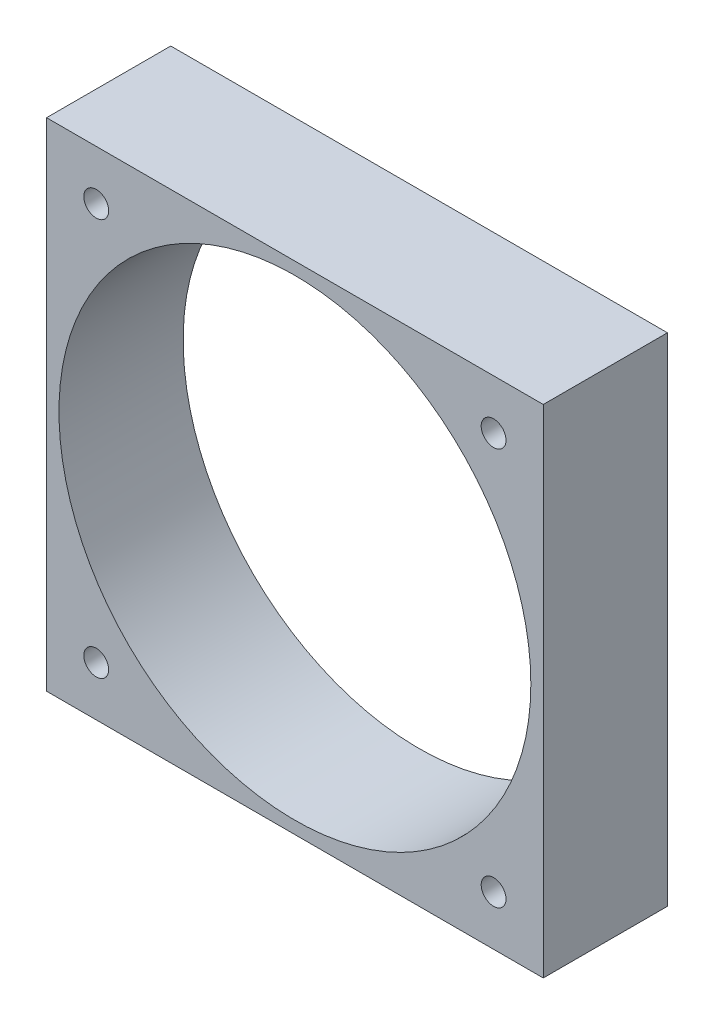
ISO-10303-21;
HEADER;
FILE_DESCRIPTION(('STEP AP214'),'2;1');
FILE_NAME('part.step','',(''),(''),'','','');
FILE_SCHEMA(('AUTOMOTIVE_DESIGN { 1 0 10303 214 1 1 1 1 }'));
ENDSEC;
DATA;
#1=APPLICATION_CONTEXT('core data for automotive mechanical design processes');
#2=APPLICATION_PROTOCOL_DEFINITION('international standard','automotive_design',2000,#1);
#3=PRODUCT_CONTEXT('',#1,'mechanical');
#4=PRODUCT('Part','Part','',(#3));
#5=PRODUCT_RELATED_PRODUCT_CATEGORY('part','',(#4));
#6=PRODUCT_DEFINITION_FORMATION('','',#4);
#7=PRODUCT_DEFINITION_CONTEXT('part definition',#1,'design');
#8=PRODUCT_DEFINITION('design','',#6,#7);
#9=PRODUCT_DEFINITION_SHAPE('','',#8);
#10=(LENGTH_UNIT() NAMED_UNIT(*) SI_UNIT(.MILLI.,.METRE.));
#11=(NAMED_UNIT(*) PLANE_ANGLE_UNIT() SI_UNIT($,.RADIAN.));
#12=(NAMED_UNIT(*) SI_UNIT($,.STERADIAN.) SOLID_ANGLE_UNIT());
#13=UNCERTAINTY_MEASURE_WITH_UNIT(LENGTH_MEASURE(1.E-05),#10,'distance_accuracy_value','');
#14=(GEOMETRIC_REPRESENTATION_CONTEXT(3) GLOBAL_UNCERTAINTY_ASSIGNED_CONTEXT((#13)) GLOBAL_UNIT_ASSIGNED_CONTEXT((#10,
#11,#12)) REPRESENTATION_CONTEXT('',''));
#15=CARTESIAN_POINT('',(0.,0.,0.));
#16=DIRECTION('',(0.,0.,1.));
#17=DIRECTION('',(1.,0.,0.));
#18=AXIS2_PLACEMENT_3D('',#15,#16,#17);
#19=CARTESIAN_POINT('',(0.,0.,10.));
#20=DIRECTION('',(1.,0.,0.));
#21=DIRECTION('',(0.,0.,-1.));
#22=AXIS2_PLACEMENT_3D('',#19,#20,#21);
#23=PLANE('',#22);
#24=DIRECTION('',(0.,-1.,0.));
#25=VECTOR('',#24,1.);
#26=CARTESIAN_POINT('',(0.,0.,0.));
#27=LINE('',#26,#25);
#28=CARTESIAN_POINT('',(0.,40.,0.));
#29=VERTEX_POINT('',#28);
#30=CARTESIAN_POINT('',(0.,0.,0.));
#31=VERTEX_POINT('',#30);
#32=EDGE_CURVE('E95',#29,#31,#27,.T.);
#33=ORIENTED_EDGE('',*,*,#32,.T.);
#34=DIRECTION('',(0.,0.,-1.));
#35=VECTOR('',#34,1.);
#36=CARTESIAN_POINT('',(0.,0.,10.));
#37=LINE('',#36,#35);
#38=CARTESIAN_POINT('',(0.,0.,10.));
#39=VERTEX_POINT('',#38);
#40=EDGE_CURVE('E11',#39,#31,#37,.T.);
#41=ORIENTED_EDGE('',*,*,#40,.F.);
#42=DIRECTION('',(0.,-1.,0.));
#43=VECTOR('',#42,1.);
#44=CARTESIAN_POINT('',(0.,0.,10.));
#45=LINE('',#44,#43);
#46=CARTESIAN_POINT('',(0.,40.,10.));
#47=VERTEX_POINT('',#46);
#48=EDGE_CURVE('E83',#47,#39,#45,.T.);
#49=ORIENTED_EDGE('',*,*,#48,.F.);
#50=DIRECTION('',(0.,0.,-1.));
#51=VECTOR('',#50,1.);
#52=CARTESIAN_POINT('',(0.,40.,10.));
#53=LINE('',#52,#51);
#54=EDGE_CURVE('E91',#47,#29,#53,.T.);
#55=ORIENTED_EDGE('',*,*,#54,.T.);
#56=EDGE_LOOP('',(#33,#41,#49,#55));
#57=FACE_BOUND('',#56,.T.);
#58=ADVANCED_FACE('F32',(#57),#23,.F.);
#59=CARTESIAN_POINT('',(0.,0.,10.));
#60=DIRECTION('',(0.,1.,0.));
#61=DIRECTION('',(0.,0.,1.));
#62=AXIS2_PLACEMENT_3D('',#59,#60,#61);
#63=PLANE('',#62);
#64=DIRECTION('',(1.,0.,0.));
#65=VECTOR('',#64,1.);
#66=CARTESIAN_POINT('',(0.,0.,0.));
#67=LINE('',#66,#65);
#68=CARTESIAN_POINT('',(40.,0.,0.));
#69=VERTEX_POINT('',#68);
#70=EDGE_CURVE('E87',#31,#69,#67,.T.);
#71=ORIENTED_EDGE('',*,*,#70,.T.);
#72=DIRECTION('',(0.,0.,-1.));
#73=VECTOR('',#72,1.);
#74=CARTESIAN_POINT('',(40.,0.,10.));
#75=LINE('',#74,#73);
#76=CARTESIAN_POINT('',(40.,0.,10.));
#77=VERTEX_POINT('',#76);
#78=EDGE_CURVE('E40',#77,#69,#75,.T.);
#79=ORIENTED_EDGE('',*,*,#78,.F.);
#80=DIRECTION('',(1.,0.,0.));
#81=VECTOR('',#80,1.);
#82=CARTESIAN_POINT('',(0.,0.,10.));
#83=LINE('',#82,#81);
#84=EDGE_CURVE('E78',#39,#77,#83,.T.);
#85=ORIENTED_EDGE('',*,*,#84,.F.);
#86=ORIENTED_EDGE('',*,*,#40,.T.);
#87=EDGE_LOOP('',(#71,#79,#85,#86));
#88=FACE_BOUND('',#87,.T.);
#89=ADVANCED_FACE('F86',(#88),#63,.F.);
#90=CARTESIAN_POINT('',(40.,0.,10.));
#91=DIRECTION('',(-1.,0.,0.));
#92=DIRECTION('',(0.,0.,1.));
#93=AXIS2_PLACEMENT_3D('',#90,#91,#92);
#94=PLANE('',#93);
#95=DIRECTION('',(0.,1.,0.));
#96=VECTOR('',#95,1.);
#97=CARTESIAN_POINT('',(40.,0.,0.));
#98=LINE('',#97,#96);
#99=CARTESIAN_POINT('',(40.,40.,0.));
#100=VERTEX_POINT('',#99);
#101=EDGE_CURVE('E65',#69,#100,#98,.T.);
#102=ORIENTED_EDGE('',*,*,#101,.T.);
#103=DIRECTION('',(0.,0.,-1.));
#104=VECTOR('',#103,1.);
#105=CARTESIAN_POINT('',(40.,40.,10.));
#106=LINE('',#105,#104);
#107=CARTESIAN_POINT('',(40.,40.,10.));
#108=VERTEX_POINT('',#107);
#109=EDGE_CURVE('E88',#108,#100,#106,.T.);
#110=ORIENTED_EDGE('',*,*,#109,.F.);
#111=DIRECTION('',(0.,1.,0.));
#112=VECTOR('',#111,1.);
#113=CARTESIAN_POINT('',(40.,0.,10.));
#114=LINE('',#113,#112);
#115=EDGE_CURVE('E81',#77,#108,#114,.T.);
#116=ORIENTED_EDGE('',*,*,#115,.F.);
#117=ORIENTED_EDGE('',*,*,#78,.T.);
#118=EDGE_LOOP('',(#102,#110,#116,#117));
#119=FACE_BOUND('',#118,.T.);
#120=ADVANCED_FACE('F89',(#119),#94,.F.);
#121=CARTESIAN_POINT('',(0.,40.,10.));
#122=DIRECTION('',(0.,-1.,0.));
#123=DIRECTION('',(0.,0.,-1.));
#124=AXIS2_PLACEMENT_3D('',#121,#122,#123);
#125=PLANE('',#124);
#126=DIRECTION('',(-1.,0.,0.));
#127=VECTOR('',#126,1.);
#128=CARTESIAN_POINT('',(0.,40.,0.));
#129=LINE('',#128,#127);
#130=EDGE_CURVE('E71',#100,#29,#129,.T.);
#131=ORIENTED_EDGE('',*,*,#130,.T.);
#132=ORIENTED_EDGE('',*,*,#54,.F.);
#133=DIRECTION('',(-1.,0.,0.));
#134=VECTOR('',#133,1.);
#135=CARTESIAN_POINT('',(0.,40.,10.));
#136=LINE('',#135,#134);
#137=EDGE_CURVE('E48',#108,#47,#136,.T.);
#138=ORIENTED_EDGE('',*,*,#137,.F.);
#139=ORIENTED_EDGE('',*,*,#109,.T.);
#140=EDGE_LOOP('',(#131,#132,#138,#139));
#141=FACE_BOUND('',#140,.T.);
#142=ADVANCED_FACE('F103',(#141),#125,.F.);
#143=CARTESIAN_POINT('',(0.,0.,10.));
#144=DIRECTION('',(0.,0.,-1.));
#145=DIRECTION('',(-1.,0.,0.));
#146=AXIS2_PLACEMENT_3D('',#143,#144,#145);
#147=PLANE('',#146);
#148=CARTESIAN_POINT('',(20.,20.,10.));
#149=DIRECTION('',(0.,0.,1.));
#150=DIRECTION('',(1.,0.,0.));
#151=AXIS2_PLACEMENT_3D('',#148,#149,#150);
#152=CIRCLE('',#151,19.);
#153=CARTESIAN_POINT('',(39.,20.,10.));
#154=VERTEX_POINT('',#153);
#155=EDGE_CURVE('E133',#154,#154,#152,.T.);
#156=ORIENTED_EDGE('',*,*,#155,.F.);
#157=EDGE_LOOP('',(#156));
#158=FACE_BOUND('',#157,.T.);
#159=CARTESIAN_POINT('',(4.,4.,10.));
#160=DIRECTION('',(0.,0.,1.));
#161=DIRECTION('',(1.,0.,0.));
#162=AXIS2_PLACEMENT_3D('',#159,#160,#161);
#163=CIRCLE('',#162,1.);
#164=CARTESIAN_POINT('',(5.,4.,10.));
#165=VERTEX_POINT('',#164);
#166=EDGE_CURVE('E118',#165,#165,#163,.T.);
#167=ORIENTED_EDGE('',*,*,#166,.F.);
#168=EDGE_LOOP('',(#167));
#169=FACE_BOUND('',#168,.T.);
#170=CARTESIAN_POINT('',(36.,4.,10.));
#171=DIRECTION('',(0.,0.,1.));
#172=DIRECTION('',(1.,0.,0.));
#173=AXIS2_PLACEMENT_3D('',#170,#171,#172);
#174=CIRCLE('',#173,0.999999999999998);
#175=CARTESIAN_POINT('',(37.,4.,10.));
#176=VERTEX_POINT('',#175);
#177=EDGE_CURVE('E125',#176,#176,#174,.T.);
#178=ORIENTED_EDGE('',*,*,#177,.F.);
#179=EDGE_LOOP('',(#178));
#180=FACE_BOUND('',#179,.T.);
#181=CARTESIAN_POINT('',(36.,36.,10.));
#182=DIRECTION('',(0.,0.,1.));
#183=DIRECTION('',(1.,0.,0.));
#184=AXIS2_PLACEMENT_3D('',#181,#182,#183);
#185=CIRCLE('',#184,0.999999999999998);
#186=CARTESIAN_POINT('',(37.,36.,10.));
#187=VERTEX_POINT('',#186);
#188=EDGE_CURVE('E112',#187,#187,#185,.T.);
#189=ORIENTED_EDGE('',*,*,#188,.F.);
#190=EDGE_LOOP('',(#189));
#191=FACE_BOUND('',#190,.T.);
#192=CARTESIAN_POINT('',(4.,36.,10.));
#193=DIRECTION('',(0.,0.,1.));
#194=DIRECTION('',(1.,0.,0.));
#195=AXIS2_PLACEMENT_3D('',#192,#193,#194);
#196=CIRCLE('',#195,1.);
#197=CARTESIAN_POINT('',(5.,36.,10.));
#198=VERTEX_POINT('',#197);
#199=EDGE_CURVE('E109',#198,#198,#196,.T.);
#200=ORIENTED_EDGE('',*,*,#199,.F.);
#201=EDGE_LOOP('',(#200));
#202=FACE_BOUND('',#201,.T.);
#203=ORIENTED_EDGE('',*,*,#48,.T.);
#204=ORIENTED_EDGE('',*,*,#84,.T.);
#205=ORIENTED_EDGE('',*,*,#115,.T.);
#206=ORIENTED_EDGE('',*,*,#137,.T.);
#207=EDGE_LOOP('',(#203,#204,#205,#206));
#208=FACE_BOUND('',#207,.T.);
#209=ADVANCED_FACE('F79',(#158,#169,#180,#191,#202,#208),#147,.F.);
#210=CARTESIAN_POINT('',(0.,0.,0.));
#211=DIRECTION('',(0.,0.,-1.));
#212=DIRECTION('',(-1.,0.,0.));
#213=AXIS2_PLACEMENT_3D('',#210,#211,#212);
#214=PLANE('',#213);
#215=CARTESIAN_POINT('',(20.,20.,0.));
#216=DIRECTION('',(0.,0.,1.));
#217=DIRECTION('',(1.,0.,0.));
#218=AXIS2_PLACEMENT_3D('',#215,#216,#217);
#219=CIRCLE('',#218,19.);
#220=CARTESIAN_POINT('',(39.,20.,0.));
#221=VERTEX_POINT('',#220);
#222=EDGE_CURVE('E119',#221,#221,#219,.T.);
#223=ORIENTED_EDGE('',*,*,#222,.T.);
#224=EDGE_LOOP('',(#223));
#225=FACE_BOUND('',#224,.T.);
#226=CARTESIAN_POINT('',(4.,4.,0.));
#227=DIRECTION('',(0.,0.,1.));
#228=DIRECTION('',(1.,0.,0.));
#229=AXIS2_PLACEMENT_3D('',#226,#227,#228);
#230=CIRCLE('',#229,1.);
#231=CARTESIAN_POINT('',(5.,4.,0.));
#232=VERTEX_POINT('',#231);
#233=EDGE_CURVE('E115',#232,#232,#230,.T.);
#234=ORIENTED_EDGE('',*,*,#233,.T.);
#235=EDGE_LOOP('',(#234));
#236=FACE_BOUND('',#235,.T.);
#237=CARTESIAN_POINT('',(36.,4.,0.));
#238=DIRECTION('',(0.,0.,1.));
#239=DIRECTION('',(1.,0.,0.));
#240=AXIS2_PLACEMENT_3D('',#237,#238,#239);
#241=CIRCLE('',#240,0.999999999999998);
#242=CARTESIAN_POINT('',(37.,4.,0.));
#243=VERTEX_POINT('',#242);
#244=EDGE_CURVE('E122',#243,#243,#241,.T.);
#245=ORIENTED_EDGE('',*,*,#244,.T.);
#246=EDGE_LOOP('',(#245));
#247=FACE_BOUND('',#246,.T.);
#248=CARTESIAN_POINT('',(36.,36.,0.));
#249=DIRECTION('',(0.,0.,1.));
#250=DIRECTION('',(1.,0.,0.));
#251=AXIS2_PLACEMENT_3D('',#248,#249,#250);
#252=CIRCLE('',#251,0.999999999999998);
#253=CARTESIAN_POINT('',(37.,36.,0.));
#254=VERTEX_POINT('',#253);
#255=EDGE_CURVE('E128',#254,#254,#252,.T.);
#256=ORIENTED_EDGE('',*,*,#255,.T.);
#257=EDGE_LOOP('',(#256));
#258=FACE_BOUND('',#257,.T.);
#259=CARTESIAN_POINT('',(4.,36.,0.));
#260=DIRECTION('',(0.,0.,1.));
#261=DIRECTION('',(1.,0.,0.));
#262=AXIS2_PLACEMENT_3D('',#259,#260,#261);
#263=CIRCLE('',#262,1.);
#264=CARTESIAN_POINT('',(5.,36.,0.));
#265=VERTEX_POINT('',#264);
#266=EDGE_CURVE('E98',#265,#265,#263,.T.);
#267=ORIENTED_EDGE('',*,*,#266,.T.);
#268=EDGE_LOOP('',(#267));
#269=FACE_BOUND('',#268,.T.);
#270=ORIENTED_EDGE('',*,*,#32,.F.);
#271=ORIENTED_EDGE('',*,*,#130,.F.);
#272=ORIENTED_EDGE('',*,*,#101,.F.);
#273=ORIENTED_EDGE('',*,*,#70,.F.);
#274=EDGE_LOOP('',(#270,#271,#272,#273));
#275=FACE_BOUND('',#274,.T.);
#276=ADVANCED_FACE('F106',(#225,#236,#247,#258,#269,#275),#214,.T.);
#277=CARTESIAN_POINT('',(4.,36.,0.));
#278=DIRECTION('',(0.,0.,1.));
#279=DIRECTION('',(1.,0.,0.));
#280=AXIS2_PLACEMENT_3D('',#277,#278,#279);
#281=CYLINDRICAL_SURFACE('',#280,1.);
#282=ORIENTED_EDGE('',*,*,#266,.F.);
#283=EDGE_LOOP('',(#282));
#284=FACE_BOUND('',#283,.T.);
#285=ORIENTED_EDGE('',*,*,#199,.T.);
#286=EDGE_LOOP('',(#285));
#287=FACE_BOUND('',#286,.T.);
#288=ADVANCED_FACE('F159',(#284,#287),#281,.F.);
#289=CARTESIAN_POINT('',(36.,36.,0.));
#290=DIRECTION('',(0.,0.,1.));
#291=DIRECTION('',(1.,0.,0.));
#292=AXIS2_PLACEMENT_3D('',#289,#290,#291);
#293=CYLINDRICAL_SURFACE('',#292,0.999999999999998);
#294=ORIENTED_EDGE('',*,*,#255,.F.);
#295=EDGE_LOOP('',(#294));
#296=FACE_BOUND('',#295,.T.);
#297=ORIENTED_EDGE('',*,*,#188,.T.);
#298=EDGE_LOOP('',(#297));
#299=FACE_BOUND('',#298,.T.);
#300=ADVANCED_FACE('F161',(#296,#299),#293,.F.);
#301=CARTESIAN_POINT('',(36.,4.,0.));
#302=DIRECTION('',(0.,0.,1.));
#303=DIRECTION('',(1.,0.,0.));
#304=AXIS2_PLACEMENT_3D('',#301,#302,#303);
#305=CYLINDRICAL_SURFACE('',#304,0.999999999999998);
#306=ORIENTED_EDGE('',*,*,#244,.F.);
#307=EDGE_LOOP('',(#306));
#308=FACE_BOUND('',#307,.T.);
#309=ORIENTED_EDGE('',*,*,#177,.T.);
#310=EDGE_LOOP('',(#309));
#311=FACE_BOUND('',#310,.T.);
#312=ADVANCED_FACE('F168',(#308,#311),#305,.F.);
#313=CARTESIAN_POINT('',(4.,4.,0.));
#314=DIRECTION('',(0.,0.,1.));
#315=DIRECTION('',(1.,0.,0.));
#316=AXIS2_PLACEMENT_3D('',#313,#314,#315);
#317=CYLINDRICAL_SURFACE('',#316,1.);
#318=ORIENTED_EDGE('',*,*,#233,.F.);
#319=EDGE_LOOP('',(#318));
#320=FACE_BOUND('',#319,.T.);
#321=ORIENTED_EDGE('',*,*,#166,.T.);
#322=EDGE_LOOP('',(#321));
#323=FACE_BOUND('',#322,.T.);
#324=ADVANCED_FACE('F144',(#320,#323),#317,.F.);
#325=CARTESIAN_POINT('',(20.,20.,0.));
#326=DIRECTION('',(0.,0.,1.));
#327=DIRECTION('',(1.,0.,0.));
#328=AXIS2_PLACEMENT_3D('',#325,#326,#327);
#329=CYLINDRICAL_SURFACE('',#328,19.);
#330=ORIENTED_EDGE('',*,*,#222,.F.);
#331=EDGE_LOOP('',(#330));
#332=FACE_BOUND('',#331,.T.);
#333=ORIENTED_EDGE('',*,*,#155,.T.);
#334=EDGE_LOOP('',(#333));
#335=FACE_BOUND('',#334,.T.);
#336=ADVANCED_FACE('F141',(#332,#335),#329,.F.);
#337=CLOSED_SHELL('',(#58,#89,#120,#142,#209,#276,#288,#300,#312,#324,#336));
#338=MANIFOLD_SOLID_BREP('B2',#337);
#339=ADVANCED_BREP_SHAPE_REPRESENTATION('',(#18,#338),#14);
#340=SHAPE_DEFINITION_REPRESENTATION(#9,#339);
ENDSEC;
END-ISO-10303-21;
